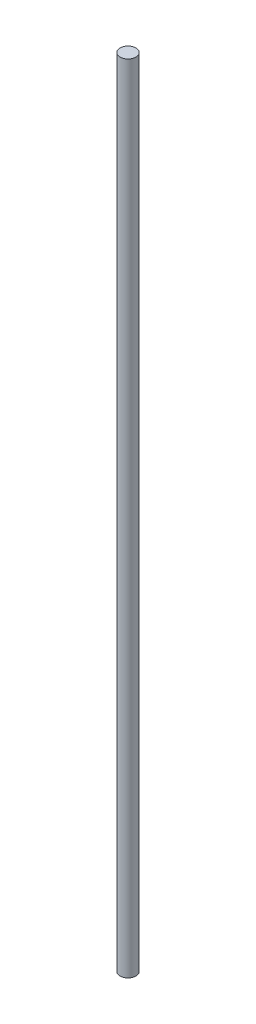
ISO-10303-21;
HEADER;
FILE_DESCRIPTION(('STEP AP214'),'2;1');
FILE_NAME('part.step','',(''),(''),'','','');
FILE_SCHEMA(('AUTOMOTIVE_DESIGN { 1 0 10303 214 1 1 1 1 }'));
ENDSEC;
DATA;
#1=APPLICATION_CONTEXT('core data for automotive mechanical design processes');
#2=APPLICATION_PROTOCOL_DEFINITION('international standard','automotive_design',2000,#1);
#3=PRODUCT_CONTEXT('',#1,'mechanical');
#4=PRODUCT('Part','Part','',(#3));
#5=PRODUCT_RELATED_PRODUCT_CATEGORY('part','',(#4));
#6=PRODUCT_DEFINITION_FORMATION('','',#4);
#7=PRODUCT_DEFINITION_CONTEXT('part definition',#1,'design');
#8=PRODUCT_DEFINITION('design','',#6,#7);
#9=PRODUCT_DEFINITION_SHAPE('','',#8);
#10=(LENGTH_UNIT() NAMED_UNIT(*) SI_UNIT(.MILLI.,.METRE.));
#11=(NAMED_UNIT(*) PLANE_ANGLE_UNIT() SI_UNIT($,.RADIAN.));
#12=(NAMED_UNIT(*) SI_UNIT($,.STERADIAN.) SOLID_ANGLE_UNIT());
#13=UNCERTAINTY_MEASURE_WITH_UNIT(LENGTH_MEASURE(1.E-05),#10,'distance_accuracy_value','');
#14=(GEOMETRIC_REPRESENTATION_CONTEXT(3) GLOBAL_UNCERTAINTY_ASSIGNED_CONTEXT((#13)) GLOBAL_UNIT_ASSIGNED_CONTEXT((#10,
#11,#12)) REPRESENTATION_CONTEXT('',''));
#15=CARTESIAN_POINT('',(0.,0.,0.));
#16=DIRECTION('',(0.,0.,1.));
#17=DIRECTION('',(1.,0.,0.));
#18=AXIS2_PLACEMENT_3D('',#15,#16,#17);
#19=CARTESIAN_POINT('',(0.,500.,0.));
#20=DIRECTION('',(0.,-1.,0.));
#21=DIRECTION('',(0.,0.,-1.));
#22=AXIS2_PLACEMENT_3D('',#19,#20,#21);
#23=CYLINDRICAL_SURFACE('',#22,5.);
#24=CARTESIAN_POINT('',(0.,500.,0.));
#25=DIRECTION('',(0.,1.,0.));
#26=DIRECTION('',(0.,0.,1.));
#27=AXIS2_PLACEMENT_3D('',#24,#25,#26);
#28=CIRCLE('',#27,5.);
#29=CARTESIAN_POINT('',(0.,500.,5.));
#30=VERTEX_POINT('',#29);
#31=EDGE_CURVE('E10',#30,#30,#28,.T.);
#32=ORIENTED_EDGE('',*,*,#31,.F.);
#33=EDGE_LOOP('',(#32));
#34=FACE_BOUND('',#33,.T.);
#35=CARTESIAN_POINT('',(0.,0.,0.));
#36=DIRECTION('',(0.,1.,0.));
#37=DIRECTION('',(0.,0.,1.));
#38=AXIS2_PLACEMENT_3D('',#35,#36,#37);
#39=CIRCLE('',#38,5.);
#40=CARTESIAN_POINT('',(0.,0.,5.));
#41=VERTEX_POINT('',#40);
#42=EDGE_CURVE('E34',#41,#41,#39,.T.);
#43=ORIENTED_EDGE('',*,*,#42,.T.);
#44=EDGE_LOOP('',(#43));
#45=FACE_BOUND('',#44,.T.);
#46=ADVANCED_FACE('F31',(#34,#45),#23,.T.);
#47=CARTESIAN_POINT('',(0.,500.,0.));
#48=DIRECTION('',(0.,1.,0.));
#49=DIRECTION('',(0.,0.,1.));
#50=AXIS2_PLACEMENT_3D('',#47,#48,#49);
#51=PLANE('',#50);
#52=ORIENTED_EDGE('',*,*,#31,.T.);
#53=EDGE_LOOP('',(#52));
#54=FACE_BOUND('',#53,.T.);
#55=ADVANCED_FACE('F46',(#54),#51,.T.);
#56=CARTESIAN_POINT('',(0.,0.,0.));
#57=DIRECTION('',(0.,1.,0.));
#58=DIRECTION('',(0.,0.,1.));
#59=AXIS2_PLACEMENT_3D('',#56,#57,#58);
#60=PLANE('',#59);
#61=ORIENTED_EDGE('',*,*,#42,.F.);
#62=EDGE_LOOP('',(#61));
#63=FACE_BOUND('',#62,.T.);
#64=ADVANCED_FACE('F44',(#63),#60,.F.);
#65=CLOSED_SHELL('',(#46,#55,#64));
#66=MANIFOLD_SOLID_BREP('B2',#65);
#67=ADVANCED_BREP_SHAPE_REPRESENTATION('',(#18,#66),#14);
#68=SHAPE_DEFINITION_REPRESENTATION(#9,#67);
ENDSEC;
END-ISO-10303-21;
